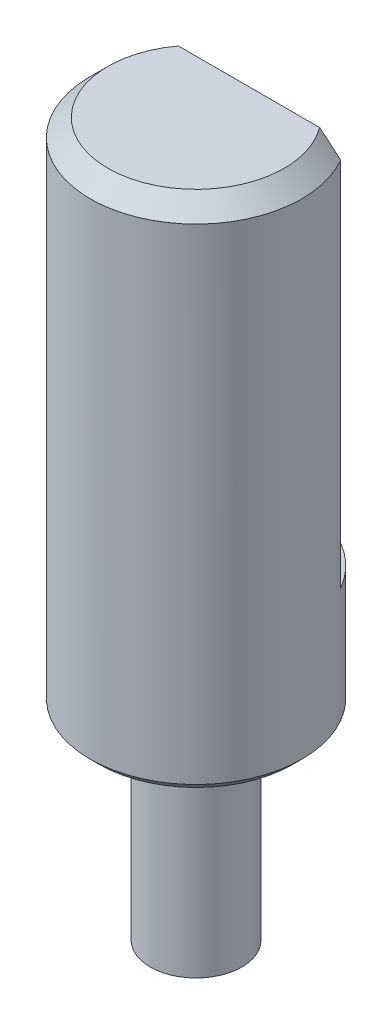
ISO-10303-21;
HEADER;
FILE_DESCRIPTION(('STEP AP214'),'2;1');
FILE_NAME('part.step','',(''),(''),'','','');
FILE_SCHEMA(('AUTOMOTIVE_DESIGN { 1 0 10303 214 1 1 1 1 }'));
ENDSEC;
DATA;
#1=APPLICATION_CONTEXT('core data for automotive mechanical design processes');
#2=APPLICATION_PROTOCOL_DEFINITION('international standard','automotive_design',2000,#1);
#3=PRODUCT_CONTEXT('',#1,'mechanical');
#4=PRODUCT('Part','Part','',(#3));
#5=PRODUCT_RELATED_PRODUCT_CATEGORY('part','',(#4));
#6=PRODUCT_DEFINITION_FORMATION('','',#4);
#7=PRODUCT_DEFINITION_CONTEXT('part definition',#1,'design');
#8=PRODUCT_DEFINITION('design','',#6,#7);
#9=PRODUCT_DEFINITION_SHAPE('','',#8);
#10=(LENGTH_UNIT() NAMED_UNIT(*) SI_UNIT(.MILLI.,.METRE.));
#11=(NAMED_UNIT(*) PLANE_ANGLE_UNIT() SI_UNIT($,.RADIAN.));
#12=(NAMED_UNIT(*) SI_UNIT($,.STERADIAN.) SOLID_ANGLE_UNIT());
#13=UNCERTAINTY_MEASURE_WITH_UNIT(LENGTH_MEASURE(1.E-05),#10,'distance_accuracy_value','');
#14=(GEOMETRIC_REPRESENTATION_CONTEXT(3) GLOBAL_UNCERTAINTY_ASSIGNED_CONTEXT((#13)) GLOBAL_UNIT_ASSIGNED_CONTEXT((#10,
#11,#12)) REPRESENTATION_CONTEXT('',''));
#15=CARTESIAN_POINT('',(0.,0.,0.));
#16=DIRECTION('',(0.,0.,1.));
#17=DIRECTION('',(1.,0.,0.));
#18=AXIS2_PLACEMENT_3D('',#15,#16,#17);
#19=CARTESIAN_POINT('',(0.,5.7,0.));
#20=DIRECTION('',(0.,-1.,0.));
#21=DIRECTION('',(0.,0.,-1.));
#22=AXIS2_PLACEMENT_3D('',#19,#20,#21);
#23=CYLINDRICAL_SURFACE('',#22,1.3);
#24=CARTESIAN_POINT('',(0.,5.7,0.));
#25=DIRECTION('',(0.,1.,0.));
#26=DIRECTION('',(0.,0.,1.));
#27=AXIS2_PLACEMENT_3D('',#24,#25,#26);
#28=CIRCLE('',#27,1.3);
#29=CARTESIAN_POINT('',(0.,5.7,1.3));
#30=VERTEX_POINT('',#29);
#31=EDGE_CURVE('E84',#30,#30,#28,.T.);
#32=ORIENTED_EDGE('',*,*,#31,.F.);
#33=EDGE_LOOP('',(#32));
#34=FACE_BOUND('',#33,.T.);
#35=CARTESIAN_POINT('',(0.,0.,0.));
#36=DIRECTION('',(0.,1.,0.));
#37=DIRECTION('',(0.,0.,1.));
#38=AXIS2_PLACEMENT_3D('',#35,#36,#37);
#39=CIRCLE('',#38,1.3);
#40=CARTESIAN_POINT('',(0.,0.,1.3));
#41=VERTEX_POINT('',#40);
#42=EDGE_CURVE('E80',#41,#41,#39,.T.);
#43=ORIENTED_EDGE('',*,*,#42,.T.);
#44=EDGE_LOOP('',(#43));
#45=FACE_BOUND('',#44,.T.);
#46=ADVANCED_FACE('F32',(#34,#45),#23,.T.);
#47=CARTESIAN_POINT('',(0.,0.,0.));
#48=DIRECTION('',(0.,1.,0.));
#49=DIRECTION('',(0.,0.,1.));
#50=AXIS2_PLACEMENT_3D('',#47,#48,#49);
#51=PLANE('',#50);
#52=ORIENTED_EDGE('',*,*,#42,.F.);
#53=EDGE_LOOP('',(#52));
#54=FACE_BOUND('',#53,.T.);
#55=ADVANCED_FACE('F124',(#54),#51,.F.);
#56=CARTESIAN_POINT('',(0.,20.2,0.));
#57=DIRECTION('',(0.,-1.,0.));
#58=DIRECTION('',(0.,0.,-1.));
#59=AXIS2_PLACEMENT_3D('',#56,#57,#58);
#60=CYLINDRICAL_SURFACE('',#59,3.);
#61=DIRECTION('',(0.,1.,0.));
#62=VECTOR('',#61,1.);
#63=CARTESIAN_POINT('',(2.59807621135332,9.2,-1.5));
#64=LINE('',#63,#62);
#65=CARTESIAN_POINT('',(2.59807621135332,9.2,-1.5));
#66=VERTEX_POINT('',#65);
#67=CARTESIAN_POINT('',(2.59807621135332,19.7,-1.5));
#68=VERTEX_POINT('',#67);
#69=EDGE_CURVE('E75',#66,#68,#64,.T.);
#70=ORIENTED_EDGE('',*,*,#69,.T.);
#71=CARTESIAN_POINT('',(0.,19.7,0.));
#72=DIRECTION('',(0.,1.,0.));
#73=DIRECTION('',(0.,0.,1.));
#74=AXIS2_PLACEMENT_3D('',#71,#72,#73);
#75=CIRCLE('',#74,3.);
#76=CARTESIAN_POINT('',(-2.59807621135332,19.7,-1.5));
#77=VERTEX_POINT('',#76);
#78=EDGE_CURVE('E11',#68,#77,#75,.F.);
#79=ORIENTED_EDGE('',*,*,#78,.T.);
#80=DIRECTION('',(0.,1.,0.));
#81=VECTOR('',#80,1.);
#82=CARTESIAN_POINT('',(-2.59807621135332,9.2,-1.5));
#83=LINE('',#82,#81);
#84=CARTESIAN_POINT('',(-2.59807621135332,9.2,-1.5));
#85=VERTEX_POINT('',#84);
#86=EDGE_CURVE('E73',#85,#77,#83,.T.);
#87=ORIENTED_EDGE('',*,*,#86,.F.);
#88=CARTESIAN_POINT('',(0.,9.2,0.));
#89=DIRECTION('',(0.,1.,0.));
#90=DIRECTION('',(0.,0.,1.));
#91=AXIS2_PLACEMENT_3D('',#88,#89,#90);
#92=CIRCLE('',#91,3.);
#93=EDGE_CURVE('E66',#66,#85,#92,.T.);
#94=ORIENTED_EDGE('',*,*,#93,.F.);
#95=EDGE_LOOP('',(#70,#79,#87,#94));
#96=FACE_BOUND('',#95,.T.);
#97=CARTESIAN_POINT('',(0.,5.95000000000001,0.));
#98=DIRECTION('',(0.,1.,0.));
#99=DIRECTION('',(0.,0.,1.));
#100=AXIS2_PLACEMENT_3D('',#97,#98,#99);
#101=CIRCLE('',#100,3.);
#102=CARTESIAN_POINT('',(0.,5.95000000000001,3.));
#103=VERTEX_POINT('',#102);
#104=EDGE_CURVE('E87',#103,#103,#101,.T.);
#105=ORIENTED_EDGE('',*,*,#104,.T.);
#106=EDGE_LOOP('',(#105));
#107=FACE_BOUND('',#106,.T.);
#108=ADVANCED_FACE('F77',(#96,#107),#60,.T.);
#109=CARTESIAN_POINT('',(0.,20.2,0.));
#110=DIRECTION('',(0.,1.,0.));
#111=DIRECTION('',(0.,0.,1.));
#112=AXIS2_PLACEMENT_3D('',#109,#110,#111);
#113=PLANE('',#112);
#114=DIRECTION('',(1.,0.,0.));
#115=VECTOR('',#114,1.);
#116=CARTESIAN_POINT('',(-2.59807621135332,20.2,-1.5));
#117=LINE('',#116,#115);
#118=CARTESIAN_POINT('',(-2.00000000000001,20.2,-1.5));
#119=VERTEX_POINT('',#118);
#120=CARTESIAN_POINT('',(2.00000000000001,20.2,-1.5));
#121=VERTEX_POINT('',#120);
#122=EDGE_CURVE('E70',#119,#121,#117,.T.);
#123=ORIENTED_EDGE('',*,*,#122,.F.);
#124=CARTESIAN_POINT('',(0.,20.2,0.));
#125=DIRECTION('',(0.,1.,0.));
#126=DIRECTION('',(0.,0.,1.));
#127=AXIS2_PLACEMENT_3D('',#124,#125,#126);
#128=CIRCLE('',#127,2.50000000000001);
#129=EDGE_CURVE('E95',#119,#121,#128,.T.);
#130=ORIENTED_EDGE('',*,*,#129,.T.);
#131=EDGE_LOOP('',(#123,#130));
#132=FACE_BOUND('',#131,.T.);
#133=ADVANCED_FACE('F113',(#132),#113,.T.);
#134=CARTESIAN_POINT('',(0.,5.7,0.));
#135=DIRECTION('',(0.,1.,0.));
#136=DIRECTION('',(0.,0.,1.));
#137=AXIS2_PLACEMENT_3D('',#134,#135,#136);
#138=PLANE('',#137);
#139=CARTESIAN_POINT('',(0.,5.7,0.));
#140=DIRECTION('',(0.,1.,0.));
#141=DIRECTION('',(0.,0.,1.));
#142=AXIS2_PLACEMENT_3D('',#139,#140,#141);
#143=CIRCLE('',#142,2.74999999999999);
#144=CARTESIAN_POINT('',(0.,5.7,2.74999999999999));
#145=VERTEX_POINT('',#144);
#146=EDGE_CURVE('E92',#145,#145,#143,.F.);
#147=ORIENTED_EDGE('',*,*,#146,.T.);
#148=EDGE_LOOP('',(#147));
#149=FACE_BOUND('',#148,.T.);
#150=ORIENTED_EDGE('',*,*,#31,.T.);
#151=EDGE_LOOP('',(#150));
#152=FACE_BOUND('',#151,.T.);
#153=ADVANCED_FACE('F117',(#149,#152),#138,.F.);
#154=CARTESIAN_POINT('',(0.,5.95000000000001,0.));
#155=DIRECTION('',(0.,1.,0.));
#156=DIRECTION('',(0.,0.,1.));
#157=AXIS2_PLACEMENT_3D('',#154,#155,#156);
#158=CONICAL_SURFACE('',#157,3.,0.785398163397448);
#159=ORIENTED_EDGE('',*,*,#146,.F.);
#160=EDGE_LOOP('',(#159));
#161=FACE_BOUND('',#160,.T.);
#162=ORIENTED_EDGE('',*,*,#104,.F.);
#163=EDGE_LOOP('',(#162));
#164=FACE_BOUND('',#163,.T.);
#165=ADVANCED_FACE('F112',(#161,#164),#158,.T.);
#166=CARTESIAN_POINT('',(-2.59807621135332,9.2,-1.5));
#167=DIRECTION('',(0.,0.,1.));
#168=DIRECTION('',(1.,0.,0.));
#169=AXIS2_PLACEMENT_3D('',#166,#167,#168);
#170=PLANE('',#169);
#171=ORIENTED_EDGE('',*,*,#122,.T.);
#172=CARTESIAN_POINT('',(2.00000000000001,20.2,-1.5));
#173=CARTESIAN_POINT('',(2.05073096834371,20.1594091541126,-1.5));
#174=CARTESIAN_POINT('',(2.10119559346293,20.1184877796223,-1.5));
#175=CARTESIAN_POINT('',(2.20165596476533,20.0360826364181,-1.5));
#176=CARTESIAN_POINT('',(2.25165175427951,19.9945989205613,-1.5));
#177=CARTESIAN_POINT('',(2.35124649520412,19.9111611597559,-1.5));
#178=CARTESIAN_POINT('',(2.40084545624944,19.8692071262861,-1.5));
#179=CARTESIAN_POINT('',(2.49970382878964,19.7848914399475,-1.5));
#180=CARTESIAN_POINT('',(2.54896320821956,19.7425297494666,-1.5));
#181=CARTESIAN_POINT('',(2.59807621135341,19.7000000000001,-1.5));
#182=B_SPLINE_CURVE_WITH_KNOTS('',3,(#172,#173,#174,#175,#176,#177,#178,#179,#180,#181),
.UNSPECIFIED.,.F.,.F.,(4,2,2,2,4),(0.,0.194909899355778,0.38980160348904,0.584688561258781,
0.779593675856239),.UNSPECIFIED.);
#183=EDGE_CURVE('E41',#121,#68,#182,.T.);
#184=ORIENTED_EDGE('',*,*,#183,.T.);
#185=ORIENTED_EDGE('',*,*,#69,.F.);
#186=DIRECTION('',(1.,0.,0.));
#187=VECTOR('',#186,1.);
#188=CARTESIAN_POINT('',(-2.59807621135332,9.2,-1.5));
#189=LINE('',#188,#187);
#190=EDGE_CURVE('E69',#85,#66,#189,.T.);
#191=ORIENTED_EDGE('',*,*,#190,.F.);
#192=ORIENTED_EDGE('',*,*,#86,.T.);
#193=CARTESIAN_POINT('',(-2.59807621135332,19.7,-1.5));
#194=CARTESIAN_POINT('',(-2.54896320821952,19.7425297494665,-1.5));
#195=CARTESIAN_POINT('',(-2.49970382878963,19.7848914399475,-1.5));
#196=CARTESIAN_POINT('',(-2.40084545624945,19.8692071262861,-1.5));
#197=CARTESIAN_POINT('',(-2.35124649520413,19.9111611597559,-1.5));
#198=CARTESIAN_POINT('',(-2.2516517542795,19.9945989205613,-1.5));
#199=CARTESIAN_POINT('',(-2.20165596476531,20.036082636418,-1.5));
#200=CARTESIAN_POINT('',(-2.10119559346297,20.1184877796224,-1.5));
#201=CARTESIAN_POINT('',(-2.05073096834384,20.1594091541128,-1.5));
#202=CARTESIAN_POINT('',(-2.00000000000032,20.2000000000004,-1.5));
#203=B_SPLINE_CURVE_WITH_KNOTS('',3,(#193,#194,#195,#196,#197,#198,#199,#200,#201,#202),
.UNSPECIFIED.,.F.,.F.,(4,2,2,2,4),(0.,0.194905114597462,0.389792072367198,0.584683776500454,
0.779593675856229),.UNSPECIFIED.);
#204=EDGE_CURVE('E98',#77,#119,#203,.T.);
#205=ORIENTED_EDGE('',*,*,#204,.T.);
#206=EDGE_LOOP('',(#171,#184,#185,#191,#192,#205));
#207=FACE_BOUND('',#206,.T.);
#208=ADVANCED_FACE('F72',(#207),#170,.F.);
#209=CARTESIAN_POINT('',(0.,9.2,0.));
#210=DIRECTION('',(0.,1.,0.));
#211=DIRECTION('',(0.,0.,1.));
#212=AXIS2_PLACEMENT_3D('',#209,#210,#211);
#213=PLANE('',#212);
#214=ORIENTED_EDGE('',*,*,#93,.T.);
#215=ORIENTED_EDGE('',*,*,#190,.T.);
#216=EDGE_LOOP('',(#214,#215));
#217=FACE_BOUND('',#216,.T.);
#218=ADVANCED_FACE('F68',(#217),#213,.T.);
#219=CARTESIAN_POINT('',(0.,20.2,0.));
#220=DIRECTION('',(0.,-1.,0.));
#221=DIRECTION('',(0.,0.,-1.));
#222=AXIS2_PLACEMENT_3D('',#219,#220,#221);
#223=CONICAL_SURFACE('',#222,2.50000000000001,0.785398163397447);
#224=ORIENTED_EDGE('',*,*,#204,.F.);
#225=ORIENTED_EDGE('',*,*,#78,.F.);
#226=ORIENTED_EDGE('',*,*,#183,.F.);
#227=ORIENTED_EDGE('',*,*,#129,.F.);
#228=EDGE_LOOP('',(#224,#225,#226,#227));
#229=FACE_BOUND('',#228,.T.);
#230=ADVANCED_FACE('F34',(#229),#223,.T.);
#231=CLOSED_SHELL('',(#46,#55,#108,#133,#153,#165,#208,#218,#230));
#232=MANIFOLD_SOLID_BREP('B2',#231);
#233=ADVANCED_BREP_SHAPE_REPRESENTATION('',(#18,#232),#14);
#234=SHAPE_DEFINITION_REPRESENTATION(#9,#233);
ENDSEC;
END-ISO-10303-21;
